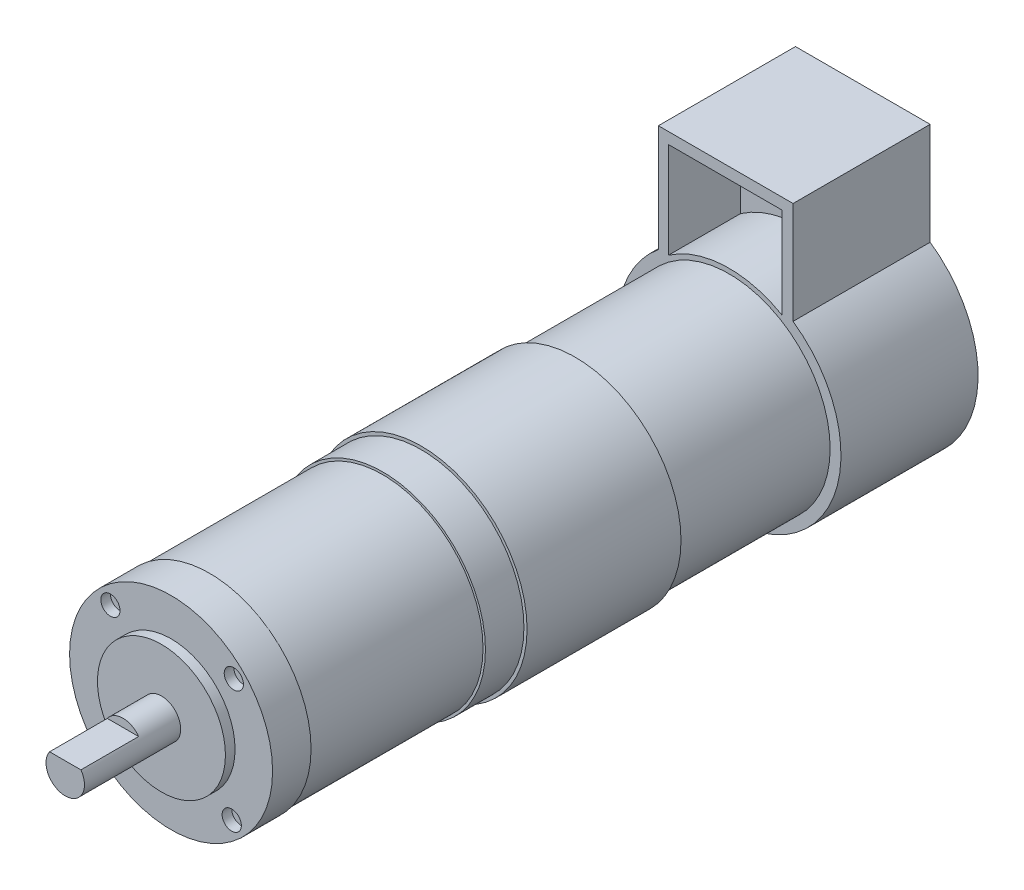
ISO-10303-21;
HEADER;
FILE_DESCRIPTION(('STEP AP214'),'2;1');
FILE_NAME('part.step','',(''),(''),'','','');
FILE_SCHEMA(('AUTOMOTIVE_DESIGN { 1 0 10303 214 1 1 1 1 }'));
ENDSEC;
DATA;
#1=APPLICATION_CONTEXT('core data for automotive mechanical design processes');
#2=APPLICATION_PROTOCOL_DEFINITION('international standard','automotive_design',2000,#1);
#3=PRODUCT_CONTEXT('',#1,'mechanical');
#4=PRODUCT('Part','Part','',(#3));
#5=PRODUCT_RELATED_PRODUCT_CATEGORY('part','',(#4));
#6=PRODUCT_DEFINITION_FORMATION('','',#4);
#7=PRODUCT_DEFINITION_CONTEXT('part definition',#1,'design');
#8=PRODUCT_DEFINITION('design','',#6,#7);
#9=PRODUCT_DEFINITION_SHAPE('','',#8);
#10=(LENGTH_UNIT() NAMED_UNIT(*) SI_UNIT(.MILLI.,.METRE.));
#11=(NAMED_UNIT(*) PLANE_ANGLE_UNIT() SI_UNIT($,.RADIAN.));
#12=(NAMED_UNIT(*) SI_UNIT($,.STERADIAN.) SOLID_ANGLE_UNIT());
#13=UNCERTAINTY_MEASURE_WITH_UNIT(LENGTH_MEASURE(1.E-05),#10,'distance_accuracy_value','');
#14=(GEOMETRIC_REPRESENTATION_CONTEXT(3) GLOBAL_UNCERTAINTY_ASSIGNED_CONTEXT((#13)) GLOBAL_UNIT_ASSIGNED_CONTEXT((#10,
#11,#12)) REPRESENTATION_CONTEXT('',''));
#15=CARTESIAN_POINT('',(0.,0.,0.));
#16=DIRECTION('',(0.,0.,1.));
#17=DIRECTION('',(1.,0.,0.));
#18=AXIS2_PLACEMENT_3D('',#15,#16,#17);
#19=CARTESIAN_POINT('',(0.,0.,28.5));
#20=DIRECTION('',(0.,0.,-1.));
#21=DIRECTION('',(-1.,0.,0.));
#22=AXIS2_PLACEMENT_3D('',#19,#20,#21);
#23=CYLINDRICAL_SURFACE('',#22,23.25);
#24=CARTESIAN_POINT('',(0.,0.,0.));
#25=DIRECTION('',(0.,0.,-1.));
#26=DIRECTION('',(-1.,0.,0.));
#27=AXIS2_PLACEMENT_3D('',#24,#25,#26);
#28=CIRCLE('',#27,23.25);
#29=CARTESIAN_POINT('',(13.2925869165633,19.0753671803614,0.));
#30=VERTEX_POINT('',#29);
#31=CARTESIAN_POINT('',(-14.7074130834367,18.0070680676548,0.));
#32=VERTEX_POINT('',#31);
#33=EDGE_CURVE('E224',#30,#32,#28,.T.);
#34=ORIENTED_EDGE('',*,*,#33,.F.);
#35=DIRECTION('',(0.,0.,-1.));
#36=VECTOR('',#35,1.);
#37=CARTESIAN_POINT('',(13.2925869165633,19.0753671803614,28.5));
#38=LINE('',#37,#36);
#39=CARTESIAN_POINT('',(13.2925869165633,19.0753671803614,28.5));
#40=VERTEX_POINT('',#39);
#41=EDGE_CURVE('E47',#40,#30,#38,.T.);
#42=ORIENTED_EDGE('',*,*,#41,.F.);
#43=CARTESIAN_POINT('',(0.,0.,28.5));
#44=DIRECTION('',(0.,0.,-1.));
#45=DIRECTION('',(-1.,0.,0.));
#46=AXIS2_PLACEMENT_3D('',#43,#44,#45);
#47=CIRCLE('',#46,23.25);
#48=CARTESIAN_POINT('',(-14.7074130834367,18.0070680676548,28.5));
#49=VERTEX_POINT('',#48);
#50=EDGE_CURVE('E226',#40,#49,#47,.T.);
#51=ORIENTED_EDGE('',*,*,#50,.T.);
#52=DIRECTION('',(0.,0.,-1.));
#53=VECTOR('',#52,1.);
#54=CARTESIAN_POINT('',(-14.7074130834367,18.0070680676548,28.5));
#55=LINE('',#54,#53);
#56=EDGE_CURVE('E42',#49,#32,#55,.T.);
#57=ORIENTED_EDGE('',*,*,#56,.T.);
#58=EDGE_LOOP('',(#34,#42,#51,#57));
#59=FACE_BOUND('',#58,.T.);
#60=ADVANCED_FACE('F39',(#59),#23,.T.);
#61=CARTESIAN_POINT('',(-14.7074130834367,18.0070680676548,28.5));
#62=DIRECTION('',(-1.,0.,0.));
#63=DIRECTION('',(0.,-1.,0.));
#64=AXIS2_PLACEMENT_3D('',#61,#62,#63);
#65=PLANE('',#64);
#66=DIRECTION('',(0.,1.,0.));
#67=VECTOR('',#66,1.);
#68=CARTESIAN_POINT('',(-14.7074130834367,18.0070680676548,0.));
#69=LINE('',#68,#67);
#70=CARTESIAN_POINT('',(-14.7074130834367,40.3,0.));
#71=VERTEX_POINT('',#70);
#72=EDGE_CURVE('E230',#32,#71,#69,.T.);
#73=ORIENTED_EDGE('',*,*,#72,.F.);
#74=ORIENTED_EDGE('',*,*,#56,.F.);
#75=DIRECTION('',(0.,1.,0.));
#76=VECTOR('',#75,1.);
#77=CARTESIAN_POINT('',(-14.7074130834367,18.0070680676548,28.5));
#78=LINE('',#77,#76);
#79=CARTESIAN_POINT('',(-14.7074130834367,40.3,28.5));
#80=VERTEX_POINT('',#79);
#81=EDGE_CURVE('E229',#49,#80,#78,.T.);
#82=ORIENTED_EDGE('',*,*,#81,.T.);
#83=DIRECTION('',(0.,0.,1.));
#84=VECTOR('',#83,1.);
#85=CARTESIAN_POINT('',(-14.7074130834367,40.3,28.5));
#86=LINE('',#85,#84);
#87=EDGE_CURVE('E196',#71,#80,#86,.T.);
#88=ORIENTED_EDGE('',*,*,#87,.F.);
#89=EDGE_LOOP('',(#73,#74,#82,#88));
#90=FACE_BOUND('',#89,.T.);
#91=ADVANCED_FACE('F244',(#90),#65,.T.);
#92=CARTESIAN_POINT('',(0.,0.,28.5));
#93=DIRECTION('',(0.,0.,-1.));
#94=DIRECTION('',(-1.,0.,0.));
#95=AXIS2_PLACEMENT_3D('',#92,#93,#94);
#96=PLANE('',#95);
#97=DIRECTION('',(0.,1.,0.));
#98=VECTOR('',#97,1.);
#99=CARTESIAN_POINT('',(10.9603999440891,19.0753671803614,28.5));
#100=LINE('',#99,#98);
#101=CARTESIAN_POINT('',(10.9603999440891,19.0753671803614,28.5));
#102=VERTEX_POINT('',#101);
#103=CARTESIAN_POINT('',(10.9603999440891,37.9656474415252,28.5));
#104=VERTEX_POINT('',#103);
#105=EDGE_CURVE('E150',#102,#104,#100,.T.);
#106=ORIENTED_EDGE('',*,*,#105,.F.);
#107=CARTESIAN_POINT('',(0.,0.,28.5));
#108=DIRECTION('',(0.,0.,-1.));
#109=DIRECTION('',(-1.,0.,0.));
#110=AXIS2_PLACEMENT_3D('',#107,#108,#109);
#111=CIRCLE('',#110,22.);
#112=CARTESIAN_POINT('',(-12.639046625709,18.0070680676548,28.5));
#113=VERTEX_POINT('',#112);
#114=EDGE_CURVE('E55',#113,#102,#111,.T.);
#115=ORIENTED_EDGE('',*,*,#114,.F.);
#116=DIRECTION('',(0.,-1.,0.));
#117=VECTOR('',#116,1.);
#118=CARTESIAN_POINT('',(-12.639046625709,37.9656474415252,28.5));
#119=LINE('',#118,#117);
#120=CARTESIAN_POINT('',(-12.639046625709,37.9656474415252,28.5));
#121=VERTEX_POINT('',#120);
#122=EDGE_CURVE('E138',#121,#113,#119,.T.);
#123=ORIENTED_EDGE('',*,*,#122,.F.);
#124=DIRECTION('',(-1.,0.,0.));
#125=VECTOR('',#124,1.);
#126=CARTESIAN_POINT('',(10.9603999440891,37.9656474415252,28.5));
#127=LINE('',#126,#125);
#128=EDGE_CURVE('E141',#104,#121,#127,.T.);
#129=ORIENTED_EDGE('',*,*,#128,.F.);
#130=EDGE_LOOP('',(#106,#115,#123,#129));
#131=FACE_BOUND('',#130,.T.);
#132=ORIENTED_EDGE('',*,*,#50,.F.);
#133=DIRECTION('',(0.,-1.,0.));
#134=VECTOR('',#133,1.);
#135=CARTESIAN_POINT('',(13.2925869165633,40.3,28.5));
#136=LINE('',#135,#134);
#137=CARTESIAN_POINT('',(13.2925869165633,40.3,28.5));
#138=VERTEX_POINT('',#137);
#139=EDGE_CURVE('E202',#138,#40,#136,.T.);
#140=ORIENTED_EDGE('',*,*,#139,.F.);
#141=DIRECTION('',(1.,0.,0.));
#142=VECTOR('',#141,1.);
#143=CARTESIAN_POINT('',(13.2925869165633,40.3,28.5));
#144=LINE('',#143,#142);
#145=EDGE_CURVE('E186',#80,#138,#144,.T.);
#146=ORIENTED_EDGE('',*,*,#145,.F.);
#147=ORIENTED_EDGE('',*,*,#81,.F.);
#148=EDGE_LOOP('',(#132,#140,#146,#147));
#149=FACE_BOUND('',#148,.T.);
#150=CARTESIAN_POINT('',(0.,0.,28.5));
#151=DIRECTION('',(0.,0.,1.));
#152=DIRECTION('',(1.,0.,0.));
#153=AXIS2_PLACEMENT_3D('',#150,#151,#152);
#154=CIRCLE('',#153,21.);
#155=CARTESIAN_POINT('',(21.,0.,28.5));
#156=VERTEX_POINT('',#155);
#157=EDGE_CURVE('E11',#156,#156,#154,.T.);
#158=ORIENTED_EDGE('',*,*,#157,.F.);
#159=EDGE_LOOP('',(#158));
#160=FACE_BOUND('',#159,.T.);
#161=ADVANCED_FACE('F254',(#131,#149,#160),#96,.F.);
#162=CARTESIAN_POINT('',(0.,0.,0.));
#163=DIRECTION('',(0.,0.,-1.));
#164=DIRECTION('',(-1.,0.,0.));
#165=AXIS2_PLACEMENT_3D('',#162,#163,#164);
#166=PLANE('',#165);
#167=ORIENTED_EDGE('',*,*,#33,.T.);
#168=ORIENTED_EDGE('',*,*,#72,.T.);
#169=DIRECTION('',(-1.,0.,0.));
#170=VECTOR('',#169,1.);
#171=CARTESIAN_POINT('',(-14.7074130834367,40.3,0.));
#172=LINE('',#171,#170);
#173=CARTESIAN_POINT('',(13.2925869165633,40.3,0.));
#174=VERTEX_POINT('',#173);
#175=EDGE_CURVE('E193',#174,#71,#172,.T.);
#176=ORIENTED_EDGE('',*,*,#175,.F.);
#177=DIRECTION('',(0.,-1.,0.));
#178=VECTOR('',#177,1.);
#179=CARTESIAN_POINT('',(13.2925869165633,40.3,0.));
#180=LINE('',#179,#178);
#181=EDGE_CURVE('E199',#174,#30,#180,.T.);
#182=ORIENTED_EDGE('',*,*,#181,.T.);
#183=EDGE_LOOP('',(#167,#168,#176,#182));
#184=FACE_BOUND('',#183,.T.);
#185=ADVANCED_FACE('F247',(#184),#166,.T.);
#186=CARTESIAN_POINT('',(0.,0.,60.5));
#187=DIRECTION('',(0.,0.,-1.));
#188=DIRECTION('',(-1.,0.,0.));
#189=AXIS2_PLACEMENT_3D('',#186,#187,#188);
#190=CYLINDRICAL_SURFACE('',#189,21.);
#191=CARTESIAN_POINT('',(0.,0.,60.5));
#192=DIRECTION('',(0.,0.,1.));
#193=DIRECTION('',(1.,0.,0.));
#194=AXIS2_PLACEMENT_3D('',#191,#192,#193);
#195=CIRCLE('',#194,21.);
#196=CARTESIAN_POINT('',(21.,0.,60.5));
#197=VERTEX_POINT('',#196);
#198=EDGE_CURVE('E220',#197,#197,#195,.T.);
#199=ORIENTED_EDGE('',*,*,#198,.F.);
#200=EDGE_LOOP('',(#199));
#201=FACE_BOUND('',#200,.T.);
#202=ORIENTED_EDGE('',*,*,#157,.T.);
#203=EDGE_LOOP('',(#202));
#204=FACE_BOUND('',#203,.T.);
#205=ADVANCED_FACE('F261',(#201,#204),#190,.T.);
#206=CARTESIAN_POINT('',(0.,0.,92.5));
#207=DIRECTION('',(0.,0.,-1.));
#208=DIRECTION('',(-1.,0.,0.));
#209=AXIS2_PLACEMENT_3D('',#206,#207,#208);
#210=CYLINDRICAL_SURFACE('',#209,22.);
#211=CARTESIAN_POINT('',(0.,0.,92.5));
#212=DIRECTION('',(0.,0.,-1.));
#213=DIRECTION('',(1.,0.,0.));
#214=AXIS2_PLACEMENT_3D('',#211,#212,#213);
#215=CIRCLE('',#214,22.);
#216=CARTESIAN_POINT('',(22.,0.,92.5));
#217=VERTEX_POINT('',#216);
#218=EDGE_CURVE('E217',#217,#217,#215,.T.);
#219=ORIENTED_EDGE('',*,*,#218,.T.);
#220=EDGE_LOOP('',(#219));
#221=FACE_BOUND('',#220,.T.);
#222=CARTESIAN_POINT('',(0.,0.,60.5));
#223=DIRECTION('',(0.,0.,-1.));
#224=DIRECTION('',(1.,0.,0.));
#225=AXIS2_PLACEMENT_3D('',#222,#223,#224);
#226=CIRCLE('',#225,22.);
#227=CARTESIAN_POINT('',(22.,0.,60.5));
#228=VERTEX_POINT('',#227);
#229=EDGE_CURVE('E214',#228,#228,#226,.T.);
#230=ORIENTED_EDGE('',*,*,#229,.F.);
#231=EDGE_LOOP('',(#230));
#232=FACE_BOUND('',#231,.T.);
#233=ADVANCED_FACE('F263',(#221,#232),#210,.T.);
#234=CARTESIAN_POINT('',(0.,0.,92.5));
#235=DIRECTION('',(0.,0.,1.));
#236=DIRECTION('',(1.,0.,0.));
#237=AXIS2_PLACEMENT_3D('',#234,#235,#236);
#238=PLANE('',#237);
#239=CARTESIAN_POINT('',(0.,0.,92.5));
#240=DIRECTION('',(0.,0.,1.));
#241=DIRECTION('',(1.,0.,0.));
#242=AXIS2_PLACEMENT_3D('',#239,#240,#241);
#243=CIRCLE('',#242,21.35);
#244=CARTESIAN_POINT('',(21.35,0.,92.5));
#245=VERTEX_POINT('',#244);
#246=EDGE_CURVE('E208',#245,#245,#243,.T.);
#247=ORIENTED_EDGE('',*,*,#246,.F.);
#248=EDGE_LOOP('',(#247));
#249=FACE_BOUND('',#248,.T.);
#250=ORIENTED_EDGE('',*,*,#218,.F.);
#251=EDGE_LOOP('',(#250));
#252=FACE_BOUND('',#251,.T.);
#253=ADVANCED_FACE('F270',(#249,#252),#238,.T.);
#254=CARTESIAN_POINT('',(0.,0.,60.5));
#255=DIRECTION('',(0.,0.,1.));
#256=DIRECTION('',(1.,0.,0.));
#257=AXIS2_PLACEMENT_3D('',#254,#255,#256);
#258=PLANE('',#257);
#259=ORIENTED_EDGE('',*,*,#198,.T.);
#260=EDGE_LOOP('',(#259));
#261=FACE_BOUND('',#260,.T.);
#262=ORIENTED_EDGE('',*,*,#229,.T.);
#263=EDGE_LOOP('',(#262));
#264=FACE_BOUND('',#263,.T.);
#265=ADVANCED_FACE('F569',(#261,#264),#258,.F.);
#266=CARTESIAN_POINT('',(0.,0.,100.5));
#267=DIRECTION('',(0.,0.,-1.));
#268=DIRECTION('',(-1.,0.,0.));
#269=AXIS2_PLACEMENT_3D('',#266,#267,#268);
#270=CYLINDRICAL_SURFACE('',#269,21.35);
#271=CARTESIAN_POINT('',(0.,0.,100.5));
#272=DIRECTION('',(0.,0.,1.));
#273=DIRECTION('',(1.,0.,0.));
#274=AXIS2_PLACEMENT_3D('',#271,#272,#273);
#275=CIRCLE('',#274,21.35);
#276=CARTESIAN_POINT('',(21.35,0.,100.5));
#277=VERTEX_POINT('',#276);
#278=EDGE_CURVE('E211',#277,#277,#275,.T.);
#279=ORIENTED_EDGE('',*,*,#278,.F.);
#280=EDGE_LOOP('',(#279));
#281=FACE_BOUND('',#280,.T.);
#282=ORIENTED_EDGE('',*,*,#246,.T.);
#283=EDGE_LOOP('',(#282));
#284=FACE_BOUND('',#283,.T.);
#285=ADVANCED_FACE('F560',(#281,#284),#270,.T.);
#286=CARTESIAN_POINT('',(0.,0.,100.5));
#287=DIRECTION('',(0.,0.,1.));
#288=DIRECTION('',(1.,0.,0.));
#289=AXIS2_PLACEMENT_3D('',#286,#287,#288);
#290=PLANE('',#289);
#291=CARTESIAN_POINT('',(0.,0.,100.5));
#292=DIRECTION('',(0.,0.,1.));
#293=DIRECTION('',(1.,0.,0.));
#294=AXIS2_PLACEMENT_3D('',#291,#292,#293);
#295=CIRCLE('',#294,20.85);
#296=CARTESIAN_POINT('',(20.85,0.,100.5));
#297=VERTEX_POINT('',#296);
#298=EDGE_CURVE('E204',#297,#297,#295,.T.);
#299=ORIENTED_EDGE('',*,*,#298,.F.);
#300=EDGE_LOOP('',(#299));
#301=FACE_BOUND('',#300,.T.);
#302=ORIENTED_EDGE('',*,*,#278,.T.);
#303=EDGE_LOOP('',(#302));
#304=FACE_BOUND('',#303,.T.);
#305=ADVANCED_FACE('F551',(#301,#304),#290,.T.);
#306=CARTESIAN_POINT('',(0.,0.,136.5));
#307=DIRECTION('',(0.,0.,-1.));
#308=DIRECTION('',(-1.,0.,0.));
#309=AXIS2_PLACEMENT_3D('',#306,#307,#308);
#310=CYLINDRICAL_SURFACE('',#309,20.85);
#311=CARTESIAN_POINT('',(0.,0.,136.5));
#312=DIRECTION('',(0.,0.,1.));
#313=DIRECTION('',(1.,0.,0.));
#314=AXIS2_PLACEMENT_3D('',#311,#312,#313);
#315=CIRCLE('',#314,20.85);
#316=CARTESIAN_POINT('',(20.85,0.,136.5));
#317=VERTEX_POINT('',#316);
#318=EDGE_CURVE('E205',#317,#317,#315,.T.);
#319=ORIENTED_EDGE('',*,*,#318,.F.);
#320=EDGE_LOOP('',(#319));
#321=FACE_BOUND('',#320,.T.);
#322=ORIENTED_EDGE('',*,*,#298,.T.);
#323=EDGE_LOOP('',(#322));
#324=FACE_BOUND('',#323,.T.);
#325=ADVANCED_FACE('F522',(#321,#324),#310,.T.);
#326=CARTESIAN_POINT('',(13.2925869165633,40.3,0.));
#327=DIRECTION('',(-1.,0.,0.));
#328=DIRECTION('',(0.,-1.,0.));
#329=AXIS2_PLACEMENT_3D('',#326,#327,#328);
#330=PLANE('',#329);
#331=ORIENTED_EDGE('',*,*,#41,.T.);
#332=ORIENTED_EDGE('',*,*,#181,.F.);
#333=DIRECTION('',(0.,0.,-1.));
#334=VECTOR('',#333,1.);
#335=CARTESIAN_POINT('',(13.2925869165633,40.3,0.));
#336=LINE('',#335,#334);
#337=EDGE_CURVE('E191',#138,#174,#336,.T.);
#338=ORIENTED_EDGE('',*,*,#337,.F.);
#339=ORIENTED_EDGE('',*,*,#139,.T.);
#340=EDGE_LOOP('',(#331,#332,#338,#339));
#341=FACE_BOUND('',#340,.T.);
#342=ADVANCED_FACE('F248',(#341),#330,.F.);
#343=CARTESIAN_POINT('',(0.,40.3,0.));
#344=DIRECTION('',(0.,-1.,0.));
#345=DIRECTION('',(1.,0.,0.));
#346=AXIS2_PLACEMENT_3D('',#343,#344,#345);
#347=PLANE('',#346);
#348=ORIENTED_EDGE('',*,*,#145,.T.);
#349=ORIENTED_EDGE('',*,*,#337,.T.);
#350=ORIENTED_EDGE('',*,*,#175,.T.);
#351=ORIENTED_EDGE('',*,*,#87,.T.);
#352=EDGE_LOOP('',(#348,#349,#350,#351));
#353=FACE_BOUND('',#352,.T.);
#354=ADVANCED_FACE('F252',(#353),#347,.F.);
#355=CARTESIAN_POINT('',(0.,0.,144.5));
#356=DIRECTION('',(0.,0.,-1.));
#357=DIRECTION('',(-1.,0.,0.));
#358=AXIS2_PLACEMENT_3D('',#355,#356,#357);
#359=CYLINDRICAL_SURFACE('',#358,21.1);
#360=CARTESIAN_POINT('',(0.,0.,144.5));
#361=DIRECTION('',(0.,0.,-1.));
#362=DIRECTION('',(1.,0.,0.));
#363=AXIS2_PLACEMENT_3D('',#360,#361,#362);
#364=CIRCLE('',#363,21.1);
#365=CARTESIAN_POINT('',(21.1,0.,144.5));
#366=VERTEX_POINT('',#365);
#367=EDGE_CURVE('E183',#366,#366,#364,.T.);
#368=ORIENTED_EDGE('',*,*,#367,.T.);
#369=EDGE_LOOP('',(#368));
#370=FACE_BOUND('',#369,.T.);
#371=CARTESIAN_POINT('',(0.,0.,136.5));
#372=DIRECTION('',(0.,0.,-1.));
#373=DIRECTION('',(1.,0.,0.));
#374=AXIS2_PLACEMENT_3D('',#371,#372,#373);
#375=CIRCLE('',#374,21.1);
#376=CARTESIAN_POINT('',(21.1,0.,136.5));
#377=VERTEX_POINT('',#376);
#378=EDGE_CURVE('E180',#377,#377,#375,.T.);
#379=ORIENTED_EDGE('',*,*,#378,.F.);
#380=EDGE_LOOP('',(#379));
#381=FACE_BOUND('',#380,.T.);
#382=ADVANCED_FACE('F501',(#370,#381),#359,.T.);
#383=CARTESIAN_POINT('',(0.,0.,144.5));
#384=DIRECTION('',(0.,0.,1.));
#385=DIRECTION('',(1.,0.,0.));
#386=AXIS2_PLACEMENT_3D('',#383,#384,#385);
#387=PLANE('',#386);
#388=CARTESIAN_POINT('',(-13.043990963551,-12.6109367222488,144.5));
#389=DIRECTION('',(0.,0.,1.));
#390=DIRECTION('',(1.,0.,0.));
#391=AXIS2_PLACEMENT_3D('',#388,#389,#390);
#392=CIRCLE('',#391,2.00000000000001);
#393=CARTESIAN_POINT('',(-11.043990963551,-12.6109367222488,144.5));
#394=VERTEX_POINT('',#393);
#395=EDGE_CURVE('E634',#394,#394,#392,.T.);
#396=ORIENTED_EDGE('',*,*,#395,.F.);
#397=EDGE_LOOP('',(#396));
#398=FACE_BOUND('',#397,.T.);
#399=CARTESIAN_POINT('',(12.6109367222501,-13.0439909635505,144.5));
#400=DIRECTION('',(0.,0.,1.));
#401=DIRECTION('',(1.,0.,0.));
#402=AXIS2_PLACEMENT_3D('',#399,#400,#401);
#403=CIRCLE('',#402,2.00000000000001);
#404=CARTESIAN_POINT('',(14.6109367222501,-13.0439909635505,144.5));
#405=VERTEX_POINT('',#404);
#406=EDGE_CURVE('E638',#405,#405,#403,.T.);
#407=ORIENTED_EDGE('',*,*,#406,.F.);
#408=EDGE_LOOP('',(#407));
#409=FACE_BOUND('',#408,.T.);
#410=CARTESIAN_POINT('',(13.0439909635517,12.6109367222506,144.5));
#411=DIRECTION('',(0.,0.,1.));
#412=DIRECTION('',(1.,0.,0.));
#413=AXIS2_PLACEMENT_3D('',#410,#411,#412);
#414=CIRCLE('',#413,2.00000000000001);
#415=CARTESIAN_POINT('',(15.0439909635517,12.6109367222506,144.5));
#416=VERTEX_POINT('',#415);
#417=EDGE_CURVE('E642',#416,#416,#414,.T.);
#418=ORIENTED_EDGE('',*,*,#417,.F.);
#419=EDGE_LOOP('',(#418));
#420=FACE_BOUND('',#419,.T.);
#421=CARTESIAN_POINT('',(-12.6109367222494,13.0439909635523,144.5));
#422=DIRECTION('',(0.,0.,1.));
#423=DIRECTION('',(1.,0.,0.));
#424=AXIS2_PLACEMENT_3D('',#421,#422,#423);
#425=CIRCLE('',#424,2.00000000000001);
#426=CARTESIAN_POINT('',(-10.6109367222494,13.0439909635523,144.5));
#427=VERTEX_POINT('',#426);
#428=EDGE_CURVE('E646',#427,#427,#425,.T.);
#429=ORIENTED_EDGE('',*,*,#428,.F.);
#430=EDGE_LOOP('',(#429));
#431=FACE_BOUND('',#430,.T.);
#432=CARTESIAN_POINT('',(0.,0.,144.5));
#433=DIRECTION('',(0.,0.,1.));
#434=DIRECTION('',(1.,0.,0.));
#435=AXIS2_PLACEMENT_3D('',#432,#433,#434);
#436=CIRCLE('',#435,13.3);
#437=CARTESIAN_POINT('',(13.3,0.,144.5));
#438=VERTEX_POINT('',#437);
#439=EDGE_CURVE('E174',#438,#438,#436,.T.);
#440=ORIENTED_EDGE('',*,*,#439,.F.);
#441=EDGE_LOOP('',(#440));
#442=FACE_BOUND('',#441,.T.);
#443=ORIENTED_EDGE('',*,*,#367,.F.);
#444=EDGE_LOOP('',(#443));
#445=FACE_BOUND('',#444,.T.);
#446=ADVANCED_FACE('F493',(#398,#409,#420,#431,#442,#445),#387,.T.);
#447=CARTESIAN_POINT('',(0.,0.,136.5));
#448=DIRECTION('',(0.,0.,1.));
#449=DIRECTION('',(1.,0.,0.));
#450=AXIS2_PLACEMENT_3D('',#447,#448,#449);
#451=PLANE('',#450);
#452=ORIENTED_EDGE('',*,*,#318,.T.);
#453=EDGE_LOOP('',(#452));
#454=FACE_BOUND('',#453,.T.);
#455=ORIENTED_EDGE('',*,*,#378,.T.);
#456=EDGE_LOOP('',(#455));
#457=FACE_BOUND('',#456,.T.);
#458=ADVANCED_FACE('F306',(#454,#457),#451,.F.);
#459=CARTESIAN_POINT('',(0.,0.,146.5));
#460=DIRECTION('',(0.,0.,-1.));
#461=DIRECTION('',(-1.,0.,0.));
#462=AXIS2_PLACEMENT_3D('',#459,#460,#461);
#463=CYLINDRICAL_SURFACE('',#462,13.3);
#464=CARTESIAN_POINT('',(0.,0.,146.5));
#465=DIRECTION('',(0.,0.,1.));
#466=DIRECTION('',(1.,0.,0.));
#467=AXIS2_PLACEMENT_3D('',#464,#465,#466);
#468=CIRCLE('',#467,13.3);
#469=CARTESIAN_POINT('',(13.3,0.,146.5));
#470=VERTEX_POINT('',#469);
#471=EDGE_CURVE('E177',#470,#470,#468,.T.);
#472=ORIENTED_EDGE('',*,*,#471,.F.);
#473=EDGE_LOOP('',(#472));
#474=FACE_BOUND('',#473,.T.);
#475=ORIENTED_EDGE('',*,*,#439,.T.);
#476=EDGE_LOOP('',(#475));
#477=FACE_BOUND('',#476,.T.);
#478=ADVANCED_FACE('F301',(#474,#477),#463,.T.);
#479=CARTESIAN_POINT('',(0.,0.,146.5));
#480=DIRECTION('',(0.,0.,1.));
#481=DIRECTION('',(1.,0.,0.));
#482=AXIS2_PLACEMENT_3D('',#479,#480,#481);
#483=PLANE('',#482);
#484=CARTESIAN_POINT('',(0.,0.,146.5));
#485=DIRECTION('',(0.,0.,1.));
#486=DIRECTION('',(1.,0.,0.));
#487=AXIS2_PLACEMENT_3D('',#484,#485,#486);
#488=CIRCLE('',#487,4.);
#489=CARTESIAN_POINT('',(4.,0.,146.5));
#490=VERTEX_POINT('',#489);
#491=EDGE_CURVE('E169',#490,#490,#488,.T.);
#492=ORIENTED_EDGE('',*,*,#491,.F.);
#493=EDGE_LOOP('',(#492));
#494=FACE_BOUND('',#493,.T.);
#495=ORIENTED_EDGE('',*,*,#471,.T.);
#496=EDGE_LOOP('',(#495));
#497=FACE_BOUND('',#496,.T.);
#498=ADVANCED_FACE('F305',(#494,#497),#483,.T.);
#499=CARTESIAN_POINT('',(0.,0.,166.5));
#500=DIRECTION('',(0.,0.,-1.));
#501=DIRECTION('',(-1.,0.,0.));
#502=AXIS2_PLACEMENT_3D('',#499,#500,#501);
#503=CYLINDRICAL_SURFACE('',#502,4.);
#504=CARTESIAN_POINT('',(0.,0.,166.5));
#505=DIRECTION('',(0.,0.,1.));
#506=DIRECTION('',(1.,0.,0.));
#507=AXIS2_PLACEMENT_3D('',#504,#505,#506);
#508=CIRCLE('',#507,4.);
#509=CARTESIAN_POINT('',(-3.25536661861992,2.32434682833159,166.5));
#510=VERTEX_POINT('',#509);
#511=CARTESIAN_POINT('',(3.25536661861992,2.32434682833159,166.5));
#512=VERTEX_POINT('',#511);
#513=EDGE_CURVE('E171',#510,#512,#508,.T.);
#514=ORIENTED_EDGE('',*,*,#513,.F.);
#515=DIRECTION('',(0.,0.,1.));
#516=VECTOR('',#515,1.);
#517=CARTESIAN_POINT('',(-3.25536661861992,2.32434682833159,154.5));
#518=LINE('',#517,#516);
#519=CARTESIAN_POINT('',(-3.25536661861992,2.32434682833159,154.5));
#520=VERTEX_POINT('',#519);
#521=EDGE_CURVE('E63',#520,#510,#518,.T.);
#522=ORIENTED_EDGE('',*,*,#521,.F.);
#523=CARTESIAN_POINT('',(0.,0.,154.5));
#524=DIRECTION('',(0.,0.,1.));
#525=DIRECTION('',(1.,0.,0.));
#526=AXIS2_PLACEMENT_3D('',#523,#524,#525);
#527=CIRCLE('',#526,4.);
#528=CARTESIAN_POINT('',(3.25536661861992,2.32434682833159,154.5));
#529=VERTEX_POINT('',#528);
#530=EDGE_CURVE('E160',#529,#520,#527,.T.);
#531=ORIENTED_EDGE('',*,*,#530,.F.);
#532=DIRECTION('',(0.,0.,1.));
#533=VECTOR('',#532,1.);
#534=CARTESIAN_POINT('',(3.25536661861992,2.32434682833159,154.5));
#535=LINE('',#534,#533);
#536=EDGE_CURVE('E166',#529,#512,#535,.T.);
#537=ORIENTED_EDGE('',*,*,#536,.T.);
#538=EDGE_LOOP('',(#514,#522,#531,#537));
#539=FACE_BOUND('',#538,.T.);
#540=ORIENTED_EDGE('',*,*,#491,.T.);
#541=EDGE_LOOP('',(#540));
#542=FACE_BOUND('',#541,.T.);
#543=ADVANCED_FACE('F320',(#539,#542),#503,.T.);
#544=CARTESIAN_POINT('',(0.,0.,166.5));
#545=DIRECTION('',(0.,0.,1.));
#546=DIRECTION('',(1.,0.,0.));
#547=AXIS2_PLACEMENT_3D('',#544,#545,#546);
#548=PLANE('',#547);
#549=DIRECTION('',(1.,0.,0.));
#550=VECTOR('',#549,1.);
#551=CARTESIAN_POINT('',(-3.25536661861992,2.32434682833159,166.5));
#552=LINE('',#551,#550);
#553=EDGE_CURVE('E156',#510,#512,#552,.T.);
#554=ORIENTED_EDGE('',*,*,#553,.F.);
#555=ORIENTED_EDGE('',*,*,#513,.T.);
#556=EDGE_LOOP('',(#554,#555));
#557=FACE_BOUND('',#556,.T.);
#558=ADVANCED_FACE('F328',(#557),#548,.T.);
#559=CARTESIAN_POINT('',(-3.25536661861992,2.32434682833159,154.5));
#560=DIRECTION('',(0.,-1.,0.));
#561=DIRECTION('',(0.,0.,-1.));
#562=AXIS2_PLACEMENT_3D('',#559,#560,#561);
#563=PLANE('',#562);
#564=ORIENTED_EDGE('',*,*,#553,.T.);
#565=ORIENTED_EDGE('',*,*,#536,.F.);
#566=DIRECTION('',(1.,0.,0.));
#567=VECTOR('',#566,1.);
#568=CARTESIAN_POINT('',(-3.25536661861992,2.32434682833159,154.5));
#569=LINE('',#568,#567);
#570=EDGE_CURVE('E162',#520,#529,#569,.T.);
#571=ORIENTED_EDGE('',*,*,#570,.F.);
#572=ORIENTED_EDGE('',*,*,#521,.T.);
#573=EDGE_LOOP('',(#564,#565,#571,#572));
#574=FACE_BOUND('',#573,.T.);
#575=ADVANCED_FACE('F336',(#574),#563,.F.);
#576=CARTESIAN_POINT('',(0.,0.,154.5));
#577=DIRECTION('',(0.,0.,1.));
#578=DIRECTION('',(1.,0.,0.));
#579=AXIS2_PLACEMENT_3D('',#576,#577,#578);
#580=PLANE('',#579);
#581=ORIENTED_EDGE('',*,*,#530,.T.);
#582=ORIENTED_EDGE('',*,*,#570,.T.);
#583=EDGE_LOOP('',(#581,#582));
#584=FACE_BOUND('',#583,.T.);
#585=ADVANCED_FACE('F344',(#584),#580,.T.);
#586=CARTESIAN_POINT('',(0.,0.,13.5));
#587=DIRECTION('',(0.,0.,1.));
#588=DIRECTION('',(1.,0.,0.));
#589=AXIS2_PLACEMENT_3D('',#586,#587,#588);
#590=CYLINDRICAL_SURFACE('',#589,22.);
#591=ORIENTED_EDGE('',*,*,#114,.T.);
#592=DIRECTION('',(0.,0.,1.));
#593=VECTOR('',#592,1.);
#594=CARTESIAN_POINT('',(10.9603999440891,19.0753671803614,13.5));
#595=LINE('',#594,#593);
#596=CARTESIAN_POINT('',(10.9603999440891,19.0753671803614,13.5));
#597=VERTEX_POINT('',#596);
#598=EDGE_CURVE('E116',#597,#102,#595,.T.);
#599=ORIENTED_EDGE('',*,*,#598,.F.);
#600=CARTESIAN_POINT('',(0.,0.,13.5));
#601=DIRECTION('',(0.,0.,-1.));
#602=DIRECTION('',(-1.,0.,0.));
#603=AXIS2_PLACEMENT_3D('',#600,#601,#602);
#604=CIRCLE('',#603,22.);
#605=CARTESIAN_POINT('',(-12.639046625709,18.0070680676548,13.5));
#606=VERTEX_POINT('',#605);
#607=EDGE_CURVE('E120',#606,#597,#604,.T.);
#608=ORIENTED_EDGE('',*,*,#607,.F.);
#609=DIRECTION('',(0.,0.,1.));
#610=VECTOR('',#609,1.);
#611=CARTESIAN_POINT('',(-12.639046625709,18.0070680676548,13.5));
#612=LINE('',#611,#610);
#613=EDGE_CURVE('E154',#606,#113,#612,.T.);
#614=ORIENTED_EDGE('',*,*,#613,.T.);
#615=EDGE_LOOP('',(#591,#599,#608,#614));
#616=FACE_BOUND('',#615,.T.);
#617=ADVANCED_FACE('F118',(#616),#590,.T.);
#618=CARTESIAN_POINT('',(-12.639046625709,37.9656474415252,13.5));
#619=DIRECTION('',(-1.,0.,0.));
#620=DIRECTION('',(0.,0.,1.));
#621=AXIS2_PLACEMENT_3D('',#618,#619,#620);
#622=PLANE('',#621);
#623=ORIENTED_EDGE('',*,*,#122,.T.);
#624=ORIENTED_EDGE('',*,*,#613,.F.);
#625=DIRECTION('',(0.,-1.,0.));
#626=VECTOR('',#625,1.);
#627=CARTESIAN_POINT('',(-12.639046625709,37.9656474415252,13.5));
#628=LINE('',#627,#626);
#629=CARTESIAN_POINT('',(-12.639046625709,37.9656474415252,13.5));
#630=VERTEX_POINT('',#629);
#631=EDGE_CURVE('E126',#630,#606,#628,.T.);
#632=ORIENTED_EDGE('',*,*,#631,.F.);
#633=DIRECTION('',(0.,0.,1.));
#634=VECTOR('',#633,1.);
#635=CARTESIAN_POINT('',(-12.639046625709,37.9656474415252,13.5));
#636=LINE('',#635,#634);
#637=EDGE_CURVE('E157',#630,#121,#636,.T.);
#638=ORIENTED_EDGE('',*,*,#637,.T.);
#639=EDGE_LOOP('',(#623,#624,#632,#638));
#640=FACE_BOUND('',#639,.T.);
#641=ADVANCED_FACE('F356',(#640),#622,.F.);
#642=CARTESIAN_POINT('',(10.9603999440891,37.9656474415252,13.5));
#643=DIRECTION('',(0.,1.,0.));
#644=DIRECTION('',(0.,0.,1.));
#645=AXIS2_PLACEMENT_3D('',#642,#643,#644);
#646=PLANE('',#645);
#647=ORIENTED_EDGE('',*,*,#128,.T.);
#648=ORIENTED_EDGE('',*,*,#637,.F.);
#649=DIRECTION('',(-1.,0.,0.));
#650=VECTOR('',#649,1.);
#651=CARTESIAN_POINT('',(10.9603999440891,37.9656474415252,13.5));
#652=LINE('',#651,#650);
#653=CARTESIAN_POINT('',(10.9603999440891,37.9656474415252,13.5));
#654=VERTEX_POINT('',#653);
#655=EDGE_CURVE('E134',#654,#630,#652,.T.);
#656=ORIENTED_EDGE('',*,*,#655,.F.);
#657=DIRECTION('',(0.,0.,1.));
#658=VECTOR('',#657,1.);
#659=CARTESIAN_POINT('',(10.9603999440891,37.9656474415252,13.5));
#660=LINE('',#659,#658);
#661=EDGE_CURVE('E125',#654,#104,#660,.T.);
#662=ORIENTED_EDGE('',*,*,#661,.T.);
#663=EDGE_LOOP('',(#647,#648,#656,#662));
#664=FACE_BOUND('',#663,.T.);
#665=ADVANCED_FACE('F363',(#664),#646,.F.);
#666=CARTESIAN_POINT('',(10.9603999440891,19.0753671803614,13.5));
#667=DIRECTION('',(1.,0.,0.));
#668=DIRECTION('',(0.,0.,-1.));
#669=AXIS2_PLACEMENT_3D('',#666,#667,#668);
#670=PLANE('',#669);
#671=ORIENTED_EDGE('',*,*,#105,.T.);
#672=ORIENTED_EDGE('',*,*,#661,.F.);
#673=DIRECTION('',(0.,1.,0.));
#674=VECTOR('',#673,1.);
#675=CARTESIAN_POINT('',(10.9603999440891,19.0753671803614,13.5));
#676=LINE('',#675,#674);
#677=EDGE_CURVE('E129',#597,#654,#676,.T.);
#678=ORIENTED_EDGE('',*,*,#677,.F.);
#679=ORIENTED_EDGE('',*,*,#598,.T.);
#680=EDGE_LOOP('',(#671,#672,#678,#679));
#681=FACE_BOUND('',#680,.T.);
#682=ADVANCED_FACE('F130',(#681),#670,.F.);
#683=CARTESIAN_POINT('',(0.,0.,13.5));
#684=DIRECTION('',(0.,0.,-1.));
#685=DIRECTION('',(-1.,0.,0.));
#686=AXIS2_PLACEMENT_3D('',#683,#684,#685);
#687=PLANE('',#686);
#688=ORIENTED_EDGE('',*,*,#607,.T.);
#689=ORIENTED_EDGE('',*,*,#677,.T.);
#690=ORIENTED_EDGE('',*,*,#655,.T.);
#691=ORIENTED_EDGE('',*,*,#631,.T.);
#692=EDGE_LOOP('',(#688,#689,#690,#691));
#693=FACE_BOUND('',#692,.T.);
#694=ADVANCED_FACE('F136',(#693),#687,.F.);
#695=CARTESIAN_POINT('',(-12.6109367222494,13.0439909635523,142.5));
#696=DIRECTION('',(0.,0.,-1.));
#697=DIRECTION('',(-1.,0.,0.));
#698=AXIS2_PLACEMENT_3D('',#695,#696,#697);
#699=PLANE('',#698);
#700=CARTESIAN_POINT('',(-12.6109367222494,13.0439909635523,142.5));
#701=DIRECTION('',(0.,0.,1.));
#702=DIRECTION('',(1.,0.,0.));
#703=AXIS2_PLACEMENT_3D('',#700,#701,#702);
#704=CIRCLE('',#703,2.);
#705=CARTESIAN_POINT('',(-10.6109367222494,13.0439909635523,142.5));
#706=VERTEX_POINT('',#705);
#707=EDGE_CURVE('E144',#706,#706,#704,.T.);
#708=ORIENTED_EDGE('',*,*,#707,.T.);
#709=EDGE_LOOP('',(#708));
#710=FACE_BOUND('',#709,.T.);
#711=ADVANCED_FACE('F384',(#710),#699,.F.);
#712=CARTESIAN_POINT('',(-12.6109367222494,13.0439909635523,144.5));
#713=DIRECTION('',(0.,0.,1.));
#714=DIRECTION('',(1.,0.,0.));
#715=AXIS2_PLACEMENT_3D('',#712,#713,#714);
#716=CYLINDRICAL_SURFACE('',#715,2.);
#717=ORIENTED_EDGE('',*,*,#707,.F.);
#718=EDGE_LOOP('',(#717));
#719=FACE_BOUND('',#718,.T.);
#720=ORIENTED_EDGE('',*,*,#428,.T.);
#721=EDGE_LOOP('',(#720));
#722=FACE_BOUND('',#721,.T.);
#723=ADVANCED_FACE('F392',(#719,#722),#716,.F.);
#724=CARTESIAN_POINT('',(13.0439909635517,12.6109367222506,142.5));
#725=DIRECTION('',(0.,0.,-1.));
#726=DIRECTION('',(-1.,0.,0.));
#727=AXIS2_PLACEMENT_3D('',#724,#725,#726);
#728=PLANE('',#727);
#729=CARTESIAN_POINT('',(13.0439909635517,12.6109367222506,142.5));
#730=DIRECTION('',(0.,0.,1.));
#731=DIRECTION('',(1.,0.,0.));
#732=AXIS2_PLACEMENT_3D('',#729,#730,#731);
#733=CIRCLE('',#732,2.);
#734=CARTESIAN_POINT('',(15.0439909635517,12.6109367222506,142.5));
#735=VERTEX_POINT('',#734);
#736=EDGE_CURVE('E650',#735,#735,#733,.T.);
#737=ORIENTED_EDGE('',*,*,#736,.T.);
#738=EDGE_LOOP('',(#737));
#739=FACE_BOUND('',#738,.T.);
#740=ADVANCED_FACE('F400',(#739),#728,.F.);
#741=CARTESIAN_POINT('',(13.0439909635517,12.6109367222506,144.5));
#742=DIRECTION('',(0.,0.,1.));
#743=DIRECTION('',(1.,0.,0.));
#744=AXIS2_PLACEMENT_3D('',#741,#742,#743);
#745=CYLINDRICAL_SURFACE('',#744,2.);
#746=ORIENTED_EDGE('',*,*,#736,.F.);
#747=EDGE_LOOP('',(#746));
#748=FACE_BOUND('',#747,.T.);
#749=ORIENTED_EDGE('',*,*,#417,.T.);
#750=EDGE_LOOP('',(#749));
#751=FACE_BOUND('',#750,.T.);
#752=ADVANCED_FACE('F408',(#748,#751),#745,.F.);
#753=CARTESIAN_POINT('',(12.6109367222501,-13.0439909635505,142.5));
#754=DIRECTION('',(0.,0.,-1.));
#755=DIRECTION('',(-1.,0.,0.));
#756=AXIS2_PLACEMENT_3D('',#753,#754,#755);
#757=PLANE('',#756);
#758=CARTESIAN_POINT('',(12.6109367222501,-13.0439909635505,142.5));
#759=DIRECTION('',(0.,0.,1.));
#760=DIRECTION('',(1.,0.,0.));
#761=AXIS2_PLACEMENT_3D('',#758,#759,#760);
#762=CIRCLE('',#761,2.);
#763=CARTESIAN_POINT('',(14.6109367222501,-13.0439909635505,142.5));
#764=VERTEX_POINT('',#763);
#765=EDGE_CURVE('E656',#764,#764,#762,.T.);
#766=ORIENTED_EDGE('',*,*,#765,.T.);
#767=EDGE_LOOP('',(#766));
#768=FACE_BOUND('',#767,.T.);
#769=ADVANCED_FACE('F416',(#768),#757,.F.);
#770=CARTESIAN_POINT('',(12.6109367222501,-13.0439909635505,144.5));
#771=DIRECTION('',(0.,0.,1.));
#772=DIRECTION('',(1.,0.,0.));
#773=AXIS2_PLACEMENT_3D('',#770,#771,#772);
#774=CYLINDRICAL_SURFACE('',#773,2.);
#775=ORIENTED_EDGE('',*,*,#765,.F.);
#776=EDGE_LOOP('',(#775));
#777=FACE_BOUND('',#776,.T.);
#778=ORIENTED_EDGE('',*,*,#406,.T.);
#779=EDGE_LOOP('',(#778));
#780=FACE_BOUND('',#779,.T.);
#781=ADVANCED_FACE('F424',(#777,#780),#774,.F.);
#782=CARTESIAN_POINT('',(-13.043990963551,-12.6109367222488,142.5));
#783=DIRECTION('',(0.,0.,-1.));
#784=DIRECTION('',(-1.,0.,0.));
#785=AXIS2_PLACEMENT_3D('',#782,#783,#784);
#786=PLANE('',#785);
#787=CARTESIAN_POINT('',(-13.043990963551,-12.6109367222488,142.5));
#788=DIRECTION('',(0.,0.,1.));
#789=DIRECTION('',(1.,0.,0.));
#790=AXIS2_PLACEMENT_3D('',#787,#788,#789);
#791=CIRCLE('',#790,2.);
#792=CARTESIAN_POINT('',(-11.043990963551,-12.6109367222488,142.5));
#793=VERTEX_POINT('',#792);
#794=EDGE_CURVE('E660',#793,#793,#791,.T.);
#795=ORIENTED_EDGE('',*,*,#794,.T.);
#796=EDGE_LOOP('',(#795));
#797=FACE_BOUND('',#796,.T.);
#798=ADVANCED_FACE('F432',(#797),#786,.F.);
#799=CARTESIAN_POINT('',(-13.043990963551,-12.6109367222488,144.5));
#800=DIRECTION('',(0.,0.,1.));
#801=DIRECTION('',(1.,0.,0.));
#802=AXIS2_PLACEMENT_3D('',#799,#800,#801);
#803=CYLINDRICAL_SURFACE('',#802,2.);
#804=ORIENTED_EDGE('',*,*,#794,.F.);
#805=EDGE_LOOP('',(#804));
#806=FACE_BOUND('',#805,.T.);
#807=ORIENTED_EDGE('',*,*,#395,.T.);
#808=EDGE_LOOP('',(#807));
#809=FACE_BOUND('',#808,.T.);
#810=ADVANCED_FACE('F440',(#806,#809),#803,.F.);
#811=CLOSED_SHELL('',(#60,#91,#161,#185,#205,#233,#253,#265,#285,#305,#325,#342,#354,#382,#446,
#458,#478,#498,#543,#558,#575,#585,#617,#641,#665,#682,#694,#711,#723,#740,#752,#769,#781,#798,#810));
#812=MANIFOLD_SOLID_BREP('B2',#811);
#813=ADVANCED_BREP_SHAPE_REPRESENTATION('',(#18,#812),#14);
#814=SHAPE_DEFINITION_REPRESENTATION(#9,#813);
ENDSEC;
END-ISO-10303-21;
